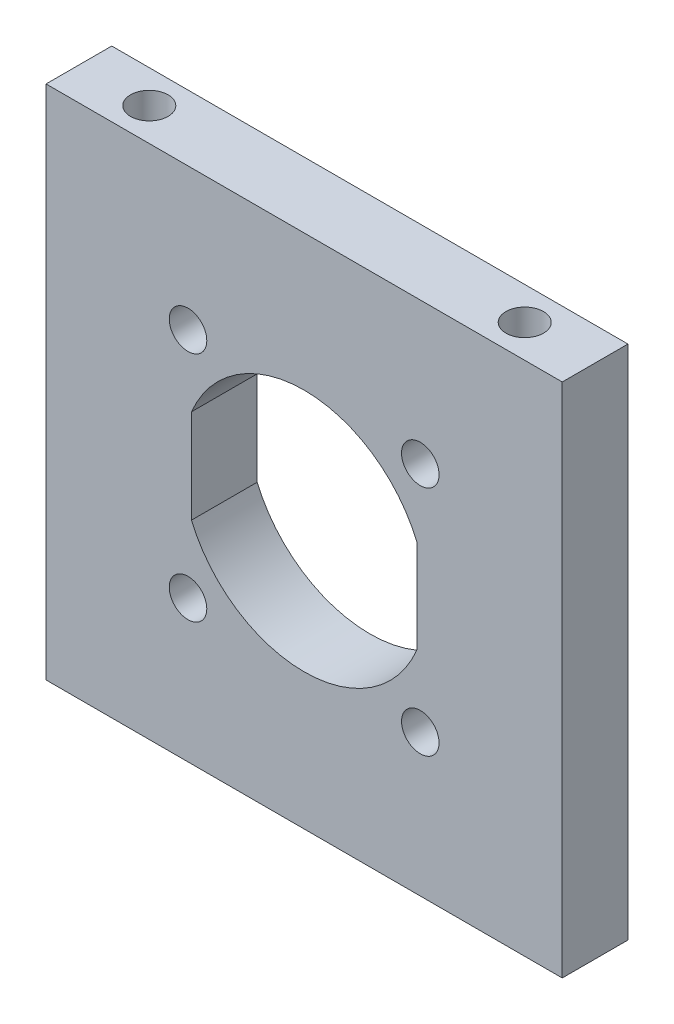
ISO-10303-21;
HEADER;
FILE_DESCRIPTION(('STEP AP214'),'2;1');
FILE_NAME('part.step','',(''),(''),'','','');
FILE_SCHEMA(('AUTOMOTIVE_DESIGN { 1 0 10303 214 1 1 1 1 }'));
ENDSEC;
DATA;
#1=APPLICATION_CONTEXT('core data for automotive mechanical design processes');
#2=APPLICATION_PROTOCOL_DEFINITION('international standard','automotive_design',2000,#1);
#3=PRODUCT_CONTEXT('',#1,'mechanical');
#4=PRODUCT('Part','Part','',(#3));
#5=PRODUCT_RELATED_PRODUCT_CATEGORY('part','',(#4));
#6=PRODUCT_DEFINITION_FORMATION('','',#4);
#7=PRODUCT_DEFINITION_CONTEXT('part definition',#1,'design');
#8=PRODUCT_DEFINITION('design','',#6,#7);
#9=PRODUCT_DEFINITION_SHAPE('','',#8);
#10=(LENGTH_UNIT() NAMED_UNIT(*) SI_UNIT(.MILLI.,.METRE.));
#11=(NAMED_UNIT(*) PLANE_ANGLE_UNIT() SI_UNIT($,.RADIAN.));
#12=(NAMED_UNIT(*) SI_UNIT($,.STERADIAN.) SOLID_ANGLE_UNIT());
#13=UNCERTAINTY_MEASURE_WITH_UNIT(LENGTH_MEASURE(1.E-05),#10,'distance_accuracy_value','');
#14=(GEOMETRIC_REPRESENTATION_CONTEXT(3) GLOBAL_UNCERTAINTY_ASSIGNED_CONTEXT((#13)) GLOBAL_UNIT_ASSIGNED_CONTEXT((#10,
#11,#12)) REPRESENTATION_CONTEXT('',''));
#15=CARTESIAN_POINT('',(0.,0.,0.));
#16=DIRECTION('',(0.,0.,1.));
#17=DIRECTION('',(1.,0.,0.));
#18=AXIS2_PLACEMENT_3D('',#15,#16,#17);
#19=CARTESIAN_POINT('',(0.,0.,7.));
#20=DIRECTION('',(0.,0.,1.));
#21=DIRECTION('',(1.,0.,0.));
#22=AXIS2_PLACEMENT_3D('',#19,#20,#21);
#23=PLANE('',#22);
#24=CARTESIAN_POINT('',(12.3743686707653,-12.3743686707639,7.));
#25=DIRECTION('',(0.,0.,1.));
#26=DIRECTION('',(1.,0.,0.));
#27=AXIS2_PLACEMENT_3D('',#24,#25,#26);
#28=CIRCLE('',#27,2.00000000000099);
#29=CARTESIAN_POINT('',(14.3743686707663,-12.3743686707639,7.));
#30=VERTEX_POINT('',#29);
#31=EDGE_CURVE('E246',#30,#30,#28,.T.);
#32=ORIENTED_EDGE('',*,*,#31,.F.);
#33=EDGE_LOOP('',(#32));
#34=FACE_BOUND('',#33,.T.);
#35=CARTESIAN_POINT('',(-12.3743686707646,12.3743686707646,7.));
#36=DIRECTION('',(0.,0.,1.));
#37=DIRECTION('',(1.,0.,0.));
#38=AXIS2_PLACEMENT_3D('',#35,#36,#37);
#39=CIRCLE('',#38,2.);
#40=CARTESIAN_POINT('',(-10.3743686707646,12.3743686707646,7.));
#41=VERTEX_POINT('',#40);
#42=EDGE_CURVE('E132',#41,#41,#39,.T.);
#43=ORIENTED_EDGE('',*,*,#42,.F.);
#44=EDGE_LOOP('',(#43));
#45=FACE_BOUND('',#44,.T.);
#46=DIRECTION('',(0.,1.,0.));
#47=VECTOR('',#46,1.);
#48=CARTESIAN_POINT('',(27.5,27.5,7.));
#49=LINE('',#48,#47);
#50=CARTESIAN_POINT('',(27.5,-27.5,7.));
#51=VERTEX_POINT('',#50);
#52=CARTESIAN_POINT('',(27.5,27.5,7.));
#53=VERTEX_POINT('',#52);
#54=EDGE_CURVE('E142',#51,#53,#49,.T.);
#55=ORIENTED_EDGE('',*,*,#54,.T.);
#56=DIRECTION('',(-1.,0.,0.));
#57=VECTOR('',#56,1.);
#58=CARTESIAN_POINT('',(-27.5,27.5,7.));
#59=LINE('',#58,#57);
#60=CARTESIAN_POINT('',(-27.5,27.5,7.));
#61=VERTEX_POINT('',#60);
#62=EDGE_CURVE('E145',#53,#61,#59,.T.);
#63=ORIENTED_EDGE('',*,*,#62,.T.);
#64=DIRECTION('',(0.,-1.,0.));
#65=VECTOR('',#64,1.);
#66=CARTESIAN_POINT('',(-27.5,27.5,7.));
#67=LINE('',#66,#65);
#68=CARTESIAN_POINT('',(-27.5,-27.5,7.));
#69=VERTEX_POINT('',#68);
#70=EDGE_CURVE('E148',#61,#69,#67,.T.);
#71=ORIENTED_EDGE('',*,*,#70,.T.);
#72=DIRECTION('',(1.,0.,0.));
#73=VECTOR('',#72,1.);
#74=CARTESIAN_POINT('',(-27.5,-27.5,7.));
#75=LINE('',#74,#73);
#76=EDGE_CURVE('E150',#69,#51,#75,.T.);
#77=ORIENTED_EDGE('',*,*,#76,.T.);
#78=EDGE_LOOP('',(#55,#63,#71,#77));
#79=FACE_BOUND('',#78,.T.);
#80=DIRECTION('',(0.,1.,0.));
#81=VECTOR('',#80,1.);
#82=CARTESIAN_POINT('',(12.,5.00000000000001,7.));
#83=LINE('',#82,#81);
#84=CARTESIAN_POINT('',(12.,-5.00000000000001,7.));
#85=VERTEX_POINT('',#84);
#86=CARTESIAN_POINT('',(12.,5.00000000000001,7.));
#87=VERTEX_POINT('',#86);
#88=EDGE_CURVE('E111',#85,#87,#83,.T.);
#89=ORIENTED_EDGE('',*,*,#88,.F.);
#90=CARTESIAN_POINT('',(0.,0.,7.));
#91=DIRECTION('',(0.,0.,1.));
#92=DIRECTION('',(1.,0.,0.));
#93=AXIS2_PLACEMENT_3D('',#90,#91,#92);
#94=CIRCLE('',#93,13.);
#95=CARTESIAN_POINT('',(-12.,-5.,7.));
#96=VERTEX_POINT('',#95);
#97=EDGE_CURVE('E103',#96,#85,#94,.T.);
#98=ORIENTED_EDGE('',*,*,#97,.F.);
#99=DIRECTION('',(0.,-1.,0.));
#100=VECTOR('',#99,1.);
#101=CARTESIAN_POINT('',(-12.,5.,7.));
#102=LINE('',#101,#100);
#103=CARTESIAN_POINT('',(-12.,5.,7.));
#104=VERTEX_POINT('',#103);
#105=EDGE_CURVE('E126',#104,#96,#102,.T.);
#106=ORIENTED_EDGE('',*,*,#105,.F.);
#107=CARTESIAN_POINT('',(0.,0.,7.));
#108=DIRECTION('',(0.,0.,1.));
#109=DIRECTION('',(1.,0.,0.));
#110=AXIS2_PLACEMENT_3D('',#107,#108,#109);
#111=CIRCLE('',#110,13.);
#112=EDGE_CURVE('E124',#87,#104,#111,.T.);
#113=ORIENTED_EDGE('',*,*,#112,.F.);
#114=EDGE_LOOP('',(#89,#98,#106,#113));
#115=FACE_BOUND('',#114,.T.);
#116=CARTESIAN_POINT('',(12.3743686707646,12.3743686707653,7.));
#117=DIRECTION('',(0.,0.,1.));
#118=DIRECTION('',(1.,0.,0.));
#119=AXIS2_PLACEMENT_3D('',#116,#117,#118);
#120=CIRCLE('',#119,2.00000000000073);
#121=CARTESIAN_POINT('',(14.3743686707653,12.3743686707653,7.));
#122=VERTEX_POINT('',#121);
#123=EDGE_CURVE('E252',#122,#122,#120,.T.);
#124=ORIENTED_EDGE('',*,*,#123,.F.);
#125=EDGE_LOOP('',(#124));
#126=FACE_BOUND('',#125,.T.);
#127=CARTESIAN_POINT('',(-12.3743686707639,-12.3743686707646,7.));
#128=DIRECTION('',(0.,0.,1.));
#129=DIRECTION('',(1.,0.,0.));
#130=AXIS2_PLACEMENT_3D('',#127,#128,#129);
#131=CIRCLE('',#130,2.00000000000038);
#132=CARTESIAN_POINT('',(-10.3743686707635,-12.3743686707646,7.));
#133=VERTEX_POINT('',#132);
#134=EDGE_CURVE('E240',#133,#133,#131,.T.);
#135=ORIENTED_EDGE('',*,*,#134,.F.);
#136=EDGE_LOOP('',(#135));
#137=FACE_BOUND('',#136,.T.);
#138=ADVANCED_FACE('F38',(#34,#45,#79,#115,#126,#137),#23,.T.);
#139=CARTESIAN_POINT('',(0.,0.,0.));
#140=DIRECTION('',(0.,0.,1.));
#141=DIRECTION('',(1.,0.,0.));
#142=AXIS2_PLACEMENT_3D('',#139,#140,#141);
#143=PLANE('',#142);
#144=DIRECTION('',(0.,1.,0.));
#145=VECTOR('',#144,1.);
#146=CARTESIAN_POINT('',(27.5,27.5,0.));
#147=LINE('',#146,#145);
#148=CARTESIAN_POINT('',(27.5,-27.5,0.));
#149=VERTEX_POINT('',#148);
#150=CARTESIAN_POINT('',(27.5,27.5,0.));
#151=VERTEX_POINT('',#150);
#152=EDGE_CURVE('E119',#149,#151,#147,.T.);
#153=ORIENTED_EDGE('',*,*,#152,.F.);
#154=DIRECTION('',(1.,0.,0.));
#155=VECTOR('',#154,1.);
#156=CARTESIAN_POINT('',(-27.5,-27.5,0.));
#157=LINE('',#156,#155);
#158=CARTESIAN_POINT('',(-27.5,-27.5,0.));
#159=VERTEX_POINT('',#158);
#160=EDGE_CURVE('E146',#159,#149,#157,.T.);
#161=ORIENTED_EDGE('',*,*,#160,.F.);
#162=DIRECTION('',(0.,-1.,0.));
#163=VECTOR('',#162,1.);
#164=CARTESIAN_POINT('',(-27.5,27.5,0.));
#165=LINE('',#164,#163);
#166=CARTESIAN_POINT('',(-27.5,27.5,0.));
#167=VERTEX_POINT('',#166);
#168=EDGE_CURVE('E157',#167,#159,#165,.T.);
#169=ORIENTED_EDGE('',*,*,#168,.F.);
#170=DIRECTION('',(-1.,0.,0.));
#171=VECTOR('',#170,1.);
#172=CARTESIAN_POINT('',(-27.5,27.5,0.));
#173=LINE('',#172,#171);
#174=EDGE_CURVE('E155',#151,#167,#173,.T.);
#175=ORIENTED_EDGE('',*,*,#174,.F.);
#176=EDGE_LOOP('',(#153,#161,#169,#175));
#177=FACE_BOUND('',#176,.T.);
#178=CARTESIAN_POINT('',(0.,0.,0.));
#179=DIRECTION('',(0.,0.,1.));
#180=DIRECTION('',(1.,0.,0.));
#181=AXIS2_PLACEMENT_3D('',#178,#179,#180);
#182=CIRCLE('',#181,13.);
#183=CARTESIAN_POINT('',(-12.,-5.,0.));
#184=VERTEX_POINT('',#183);
#185=CARTESIAN_POINT('',(12.,-5.00000000000001,0.));
#186=VERTEX_POINT('',#185);
#187=EDGE_CURVE('E61',#184,#186,#182,.T.);
#188=ORIENTED_EDGE('',*,*,#187,.T.);
#189=DIRECTION('',(0.,1.,0.));
#190=VECTOR('',#189,1.);
#191=CARTESIAN_POINT('',(12.,5.00000000000001,0.));
#192=LINE('',#191,#190);
#193=CARTESIAN_POINT('',(12.,5.00000000000001,0.));
#194=VERTEX_POINT('',#193);
#195=EDGE_CURVE('E118',#186,#194,#192,.T.);
#196=ORIENTED_EDGE('',*,*,#195,.T.);
#197=CARTESIAN_POINT('',(0.,0.,0.));
#198=DIRECTION('',(0.,0.,1.));
#199=DIRECTION('',(1.,0.,0.));
#200=AXIS2_PLACEMENT_3D('',#197,#198,#199);
#201=CIRCLE('',#200,13.);
#202=CARTESIAN_POINT('',(-12.,5.,0.));
#203=VERTEX_POINT('',#202);
#204=EDGE_CURVE('E134',#194,#203,#201,.T.);
#205=ORIENTED_EDGE('',*,*,#204,.T.);
#206=DIRECTION('',(0.,-1.,0.));
#207=VECTOR('',#206,1.);
#208=CARTESIAN_POINT('',(-12.,5.,0.));
#209=LINE('',#208,#207);
#210=EDGE_CURVE('E112',#203,#184,#209,.T.);
#211=ORIENTED_EDGE('',*,*,#210,.T.);
#212=EDGE_LOOP('',(#188,#196,#205,#211));
#213=FACE_BOUND('',#212,.T.);
#214=CARTESIAN_POINT('',(-12.3743686707646,12.3743686707646,0.));
#215=DIRECTION('',(0.,0.,1.));
#216=DIRECTION('',(1.,0.,0.));
#217=AXIS2_PLACEMENT_3D('',#214,#215,#216);
#218=CIRCLE('',#217,2.);
#219=CARTESIAN_POINT('',(-10.3743686707646,12.3743686707646,0.));
#220=VERTEX_POINT('',#219);
#221=EDGE_CURVE('E255',#220,#220,#218,.T.);
#222=ORIENTED_EDGE('',*,*,#221,.T.);
#223=EDGE_LOOP('',(#222));
#224=FACE_BOUND('',#223,.T.);
#225=CARTESIAN_POINT('',(12.3743686707646,12.3743686707653,0.));
#226=DIRECTION('',(0.,0.,1.));
#227=DIRECTION('',(1.,0.,0.));
#228=AXIS2_PLACEMENT_3D('',#225,#226,#227);
#229=CIRCLE('',#228,2.00000000000073);
#230=CARTESIAN_POINT('',(14.3743686707653,12.3743686707653,0.));
#231=VERTEX_POINT('',#230);
#232=EDGE_CURVE('E249',#231,#231,#229,.T.);
#233=ORIENTED_EDGE('',*,*,#232,.T.);
#234=EDGE_LOOP('',(#233));
#235=FACE_BOUND('',#234,.T.);
#236=CARTESIAN_POINT('',(12.3743686707653,-12.3743686707639,0.));
#237=DIRECTION('',(0.,0.,1.));
#238=DIRECTION('',(1.,0.,0.));
#239=AXIS2_PLACEMENT_3D('',#236,#237,#238);
#240=CIRCLE('',#239,2.00000000000099);
#241=CARTESIAN_POINT('',(14.3743686707663,-12.3743686707639,0.));
#242=VERTEX_POINT('',#241);
#243=EDGE_CURVE('E243',#242,#242,#240,.T.);
#244=ORIENTED_EDGE('',*,*,#243,.T.);
#245=EDGE_LOOP('',(#244));
#246=FACE_BOUND('',#245,.T.);
#247=CARTESIAN_POINT('',(-12.3743686707639,-12.3743686707646,0.));
#248=DIRECTION('',(0.,0.,1.));
#249=DIRECTION('',(1.,0.,0.));
#250=AXIS2_PLACEMENT_3D('',#247,#248,#249);
#251=CIRCLE('',#250,2.00000000000038);
#252=CARTESIAN_POINT('',(-10.3743686707635,-12.3743686707646,0.));
#253=VERTEX_POINT('',#252);
#254=EDGE_CURVE('E229',#253,#253,#251,.T.);
#255=ORIENTED_EDGE('',*,*,#254,.T.);
#256=EDGE_LOOP('',(#255));
#257=FACE_BOUND('',#256,.T.);
#258=ADVANCED_FACE('F175',(#177,#213,#224,#235,#246,#257),#143,.F.);
#259=CARTESIAN_POINT('',(27.5,27.5,7.));
#260=DIRECTION('',(-1.,0.,0.));
#261=DIRECTION('',(0.,-1.,0.));
#262=AXIS2_PLACEMENT_3D('',#259,#260,#261);
#263=PLANE('',#262);
#264=ORIENTED_EDGE('',*,*,#152,.T.);
#265=DIRECTION('',(0.,0.,-1.));
#266=VECTOR('',#265,1.);
#267=CARTESIAN_POINT('',(27.5,27.5,7.));
#268=LINE('',#267,#266);
#269=EDGE_CURVE('E11',#53,#151,#268,.T.);
#270=ORIENTED_EDGE('',*,*,#269,.F.);
#271=ORIENTED_EDGE('',*,*,#54,.F.);
#272=DIRECTION('',(0.,0.,-1.));
#273=VECTOR('',#272,1.);
#274=CARTESIAN_POINT('',(27.5,-27.5,7.));
#275=LINE('',#274,#273);
#276=EDGE_CURVE('E152',#51,#149,#275,.T.);
#277=ORIENTED_EDGE('',*,*,#276,.T.);
#278=EDGE_LOOP('',(#264,#270,#271,#277));
#279=FACE_BOUND('',#278,.T.);
#280=ADVANCED_FACE('F40',(#279),#263,.F.);
#281=CARTESIAN_POINT('',(-27.5,27.5,7.));
#282=DIRECTION('',(0.,-1.,0.));
#283=DIRECTION('',(0.,0.,-1.));
#284=AXIS2_PLACEMENT_3D('',#281,#282,#283);
#285=PLANE('',#284);
#286=CARTESIAN_POINT('',(-20.,27.5,3.5));
#287=DIRECTION('',(0.,1.,0.));
#288=DIRECTION('',(0.,0.,1.));
#289=AXIS2_PLACEMENT_3D('',#286,#287,#288);
#290=CIRCLE('',#289,2.);
#291=CARTESIAN_POINT('',(-20.,27.5,5.5));
#292=VERTEX_POINT('',#291);
#293=EDGE_CURVE('E230',#292,#292,#290,.T.);
#294=ORIENTED_EDGE('',*,*,#293,.F.);
#295=EDGE_LOOP('',(#294));
#296=FACE_BOUND('',#295,.T.);
#297=CARTESIAN_POINT('',(20.,27.5,3.5));
#298=DIRECTION('',(0.,1.,0.));
#299=DIRECTION('',(0.,0.,-1.));
#300=AXIS2_PLACEMENT_3D('',#297,#298,#299);
#301=CIRCLE('',#300,2.);
#302=CARTESIAN_POINT('',(20.,27.5,1.5));
#303=VERTEX_POINT('',#302);
#304=EDGE_CURVE('E236',#303,#303,#301,.T.);
#305=ORIENTED_EDGE('',*,*,#304,.F.);
#306=EDGE_LOOP('',(#305));
#307=FACE_BOUND('',#306,.T.);
#308=ORIENTED_EDGE('',*,*,#174,.T.);
#309=DIRECTION('',(0.,0.,-1.));
#310=VECTOR('',#309,1.);
#311=CARTESIAN_POINT('',(-27.5,27.5,7.));
#312=LINE('',#311,#310);
#313=EDGE_CURVE('E46',#61,#167,#312,.T.);
#314=ORIENTED_EDGE('',*,*,#313,.F.);
#315=ORIENTED_EDGE('',*,*,#62,.F.);
#316=ORIENTED_EDGE('',*,*,#269,.T.);
#317=EDGE_LOOP('',(#308,#314,#315,#316));
#318=FACE_BOUND('',#317,.T.);
#319=ADVANCED_FACE('F185',(#296,#307,#318),#285,.F.);
#320=CARTESIAN_POINT('',(-27.5,27.5,7.));
#321=DIRECTION('',(1.,0.,0.));
#322=DIRECTION('',(0.,1.,0.));
#323=AXIS2_PLACEMENT_3D('',#320,#321,#322);
#324=PLANE('',#323);
#325=ORIENTED_EDGE('',*,*,#168,.T.);
#326=DIRECTION('',(0.,0.,-1.));
#327=VECTOR('',#326,1.);
#328=CARTESIAN_POINT('',(-27.5,-27.5,7.));
#329=LINE('',#328,#327);
#330=EDGE_CURVE('E162',#69,#159,#329,.T.);
#331=ORIENTED_EDGE('',*,*,#330,.F.);
#332=ORIENTED_EDGE('',*,*,#70,.F.);
#333=ORIENTED_EDGE('',*,*,#313,.T.);
#334=EDGE_LOOP('',(#325,#331,#332,#333));
#335=FACE_BOUND('',#334,.T.);
#336=ADVANCED_FACE('F169',(#335),#324,.F.);
#337=CARTESIAN_POINT('',(-27.5,-27.5,7.));
#338=DIRECTION('',(0.,1.,0.));
#339=DIRECTION('',(0.,0.,1.));
#340=AXIS2_PLACEMENT_3D('',#337,#338,#339);
#341=PLANE('',#340);
#342=CARTESIAN_POINT('',(-20.,-27.5,3.5));
#343=DIRECTION('',(0.,-1.,0.));
#344=DIRECTION('',(0.,0.,-1.));
#345=AXIS2_PLACEMENT_3D('',#342,#343,#344);
#346=CIRCLE('',#345,2.);
#347=CARTESIAN_POINT('',(-20.,-27.5,1.5));
#348=VERTEX_POINT('',#347);
#349=EDGE_CURVE('E215',#348,#348,#346,.T.);
#350=ORIENTED_EDGE('',*,*,#349,.F.);
#351=EDGE_LOOP('',(#350));
#352=FACE_BOUND('',#351,.T.);
#353=CARTESIAN_POINT('',(20.,-27.5,3.49999999999996));
#354=DIRECTION('',(0.,-1.,0.));
#355=DIRECTION('',(0.,0.,1.));
#356=AXIS2_PLACEMENT_3D('',#353,#354,#355);
#357=CIRCLE('',#356,2.);
#358=CARTESIAN_POINT('',(20.,-27.5,5.49999999999997));
#359=VERTEX_POINT('',#358);
#360=EDGE_CURVE('E218',#359,#359,#357,.T.);
#361=ORIENTED_EDGE('',*,*,#360,.F.);
#362=EDGE_LOOP('',(#361));
#363=FACE_BOUND('',#362,.T.);
#364=ORIENTED_EDGE('',*,*,#160,.T.);
#365=ORIENTED_EDGE('',*,*,#276,.F.);
#366=ORIENTED_EDGE('',*,*,#76,.F.);
#367=ORIENTED_EDGE('',*,*,#330,.T.);
#368=EDGE_LOOP('',(#364,#365,#366,#367));
#369=FACE_BOUND('',#368,.T.);
#370=ADVANCED_FACE('F179',(#352,#363,#369),#341,.F.);
#371=CARTESIAN_POINT('',(0.,0.,7.));
#372=DIRECTION('',(0.,0.,-1.));
#373=DIRECTION('',(-1.,0.,0.));
#374=AXIS2_PLACEMENT_3D('',#371,#372,#373);
#375=CYLINDRICAL_SURFACE('',#374,13.);
#376=ORIENTED_EDGE('',*,*,#187,.F.);
#377=DIRECTION('',(0.,0.,-1.));
#378=VECTOR('',#377,1.);
#379=CARTESIAN_POINT('',(-12.,-5.,7.));
#380=LINE('',#379,#378);
#381=EDGE_CURVE('E107',#96,#184,#380,.T.);
#382=ORIENTED_EDGE('',*,*,#381,.F.);
#383=ORIENTED_EDGE('',*,*,#97,.T.);
#384=DIRECTION('',(0.,0.,-1.));
#385=VECTOR('',#384,1.);
#386=CARTESIAN_POINT('',(12.,-5.00000000000001,7.));
#387=LINE('',#386,#385);
#388=EDGE_CURVE('E106',#85,#186,#387,.T.);
#389=ORIENTED_EDGE('',*,*,#388,.T.);
#390=EDGE_LOOP('',(#376,#382,#383,#389));
#391=FACE_BOUND('',#390,.T.);
#392=ADVANCED_FACE('F105',(#391),#375,.F.);
#393=CARTESIAN_POINT('',(12.,5.00000000000001,7.));
#394=DIRECTION('',(-1.,0.,0.));
#395=DIRECTION('',(0.,0.,1.));
#396=AXIS2_PLACEMENT_3D('',#393,#394,#395);
#397=PLANE('',#396);
#398=ORIENTED_EDGE('',*,*,#195,.F.);
#399=ORIENTED_EDGE('',*,*,#388,.F.);
#400=ORIENTED_EDGE('',*,*,#88,.T.);
#401=DIRECTION('',(0.,0.,-1.));
#402=VECTOR('',#401,1.);
#403=CARTESIAN_POINT('',(12.,5.00000000000001,7.));
#404=LINE('',#403,#402);
#405=EDGE_CURVE('E120',#87,#194,#404,.T.);
#406=ORIENTED_EDGE('',*,*,#405,.T.);
#407=EDGE_LOOP('',(#398,#399,#400,#406));
#408=FACE_BOUND('',#407,.T.);
#409=ADVANCED_FACE('F115',(#408),#397,.T.);
#410=CARTESIAN_POINT('',(0.,0.,7.));
#411=DIRECTION('',(0.,0.,-1.));
#412=DIRECTION('',(-1.,0.,0.));
#413=AXIS2_PLACEMENT_3D('',#410,#411,#412);
#414=CYLINDRICAL_SURFACE('',#413,13.);
#415=ORIENTED_EDGE('',*,*,#204,.F.);
#416=ORIENTED_EDGE('',*,*,#405,.F.);
#417=ORIENTED_EDGE('',*,*,#112,.T.);
#418=DIRECTION('',(0.,0.,-1.));
#419=VECTOR('',#418,1.);
#420=CARTESIAN_POINT('',(-12.,5.,7.));
#421=LINE('',#420,#419);
#422=EDGE_CURVE('E53',#104,#203,#421,.T.);
#423=ORIENTED_EDGE('',*,*,#422,.T.);
#424=EDGE_LOOP('',(#415,#416,#417,#423));
#425=FACE_BOUND('',#424,.T.);
#426=ADVANCED_FACE('F277',(#425),#414,.F.);
#427=CARTESIAN_POINT('',(-12.,5.,7.));
#428=DIRECTION('',(1.,0.,0.));
#429=DIRECTION('',(0.,0.,-1.));
#430=AXIS2_PLACEMENT_3D('',#427,#428,#429);
#431=PLANE('',#430);
#432=ORIENTED_EDGE('',*,*,#210,.F.);
#433=ORIENTED_EDGE('',*,*,#422,.F.);
#434=ORIENTED_EDGE('',*,*,#105,.T.);
#435=ORIENTED_EDGE('',*,*,#381,.T.);
#436=EDGE_LOOP('',(#432,#433,#434,#435));
#437=FACE_BOUND('',#436,.T.);
#438=ADVANCED_FACE('F267',(#437),#431,.T.);
#439=CARTESIAN_POINT('',(-12.3743686707646,12.3743686707646,7.));
#440=DIRECTION('',(0.,0.,-1.));
#441=DIRECTION('',(-1.,0.,0.));
#442=AXIS2_PLACEMENT_3D('',#439,#440,#441);
#443=CYLINDRICAL_SURFACE('',#442,2.);
#444=ORIENTED_EDGE('',*,*,#42,.T.);
#445=EDGE_LOOP('',(#444));
#446=FACE_BOUND('',#445,.T.);
#447=ORIENTED_EDGE('',*,*,#221,.F.);
#448=EDGE_LOOP('',(#447));
#449=FACE_BOUND('',#448,.T.);
#450=ADVANCED_FACE('F264',(#446,#449),#443,.F.);
#451=CARTESIAN_POINT('',(12.3743686707646,12.3743686707653,7.));
#452=DIRECTION('',(0.,0.,-1.));
#453=DIRECTION('',(-1.,0.,0.));
#454=AXIS2_PLACEMENT_3D('',#451,#452,#453);
#455=CYLINDRICAL_SURFACE('',#454,2.00000000000073);
#456=ORIENTED_EDGE('',*,*,#123,.T.);
#457=EDGE_LOOP('',(#456));
#458=FACE_BOUND('',#457,.T.);
#459=ORIENTED_EDGE('',*,*,#232,.F.);
#460=EDGE_LOOP('',(#459));
#461=FACE_BOUND('',#460,.T.);
#462=ADVANCED_FACE('F266',(#458,#461),#455,.F.);
#463=CARTESIAN_POINT('',(12.3743686707653,-12.3743686707639,7.));
#464=DIRECTION('',(0.,0.,-1.));
#465=DIRECTION('',(-1.,0.,0.));
#466=AXIS2_PLACEMENT_3D('',#463,#464,#465);
#467=CYLINDRICAL_SURFACE('',#466,2.00000000000099);
#468=ORIENTED_EDGE('',*,*,#31,.T.);
#469=EDGE_LOOP('',(#468));
#470=FACE_BOUND('',#469,.T.);
#471=ORIENTED_EDGE('',*,*,#243,.F.);
#472=EDGE_LOOP('',(#471));
#473=FACE_BOUND('',#472,.T.);
#474=ADVANCED_FACE('F274',(#470,#473),#467,.F.);
#475=CARTESIAN_POINT('',(-12.3743686707639,-12.3743686707646,7.));
#476=DIRECTION('',(0.,0.,-1.));
#477=DIRECTION('',(-1.,0.,0.));
#478=AXIS2_PLACEMENT_3D('',#475,#476,#477);
#479=CYLINDRICAL_SURFACE('',#478,2.00000000000038);
#480=ORIENTED_EDGE('',*,*,#134,.T.);
#481=EDGE_LOOP('',(#480));
#482=FACE_BOUND('',#481,.T.);
#483=ORIENTED_EDGE('',*,*,#254,.F.);
#484=EDGE_LOOP('',(#483));
#485=FACE_BOUND('',#484,.T.);
#486=ADVANCED_FACE('F315',(#482,#485),#479,.F.);
#487=CARTESIAN_POINT('',(20.,18.5,3.5));
#488=DIRECTION('',(0.,1.,0.));
#489=DIRECTION('',(0.,0.,1.));
#490=AXIS2_PLACEMENT_3D('',#487,#488,#489);
#491=CYLINDRICAL_SURFACE('',#490,2.);
#492=CARTESIAN_POINT('',(20.,18.5,3.5));
#493=DIRECTION('',(0.,1.,0.));
#494=DIRECTION('',(0.,0.,-1.));
#495=AXIS2_PLACEMENT_3D('',#492,#493,#494);
#496=CIRCLE('',#495,2.);
#497=CARTESIAN_POINT('',(20.,18.5,1.5));
#498=VERTEX_POINT('',#497);
#499=EDGE_CURVE('E233',#498,#498,#496,.T.);
#500=ORIENTED_EDGE('',*,*,#499,.F.);
#501=EDGE_LOOP('',(#500));
#502=FACE_BOUND('',#501,.T.);
#503=ORIENTED_EDGE('',*,*,#304,.T.);
#504=EDGE_LOOP('',(#503));
#505=FACE_BOUND('',#504,.T.);
#506=ADVANCED_FACE('F323',(#502,#505),#491,.F.);
#507=CARTESIAN_POINT('',(20.,18.5,3.5));
#508=DIRECTION('',(0.,-1.,0.));
#509=DIRECTION('',(0.,0.,-1.));
#510=AXIS2_PLACEMENT_3D('',#507,#508,#509);
#511=PLANE('',#510);
#512=ORIENTED_EDGE('',*,*,#499,.T.);
#513=EDGE_LOOP('',(#512));
#514=FACE_BOUND('',#513,.T.);
#515=ADVANCED_FACE('F340',(#514),#511,.F.);
#516=CARTESIAN_POINT('',(-20.,18.5,3.5));
#517=DIRECTION('',(0.,1.,0.));
#518=DIRECTION('',(0.,0.,1.));
#519=AXIS2_PLACEMENT_3D('',#516,#517,#518);
#520=CYLINDRICAL_SURFACE('',#519,2.);
#521=CARTESIAN_POINT('',(-20.,18.5,3.5));
#522=DIRECTION('',(0.,1.,0.));
#523=DIRECTION('',(0.,0.,1.));
#524=AXIS2_PLACEMENT_3D('',#521,#522,#523);
#525=CIRCLE('',#524,2.);
#526=CARTESIAN_POINT('',(-20.,18.5,5.5));
#527=VERTEX_POINT('',#526);
#528=EDGE_CURVE('E226',#527,#527,#525,.T.);
#529=ORIENTED_EDGE('',*,*,#528,.F.);
#530=EDGE_LOOP('',(#529));
#531=FACE_BOUND('',#530,.T.);
#532=ORIENTED_EDGE('',*,*,#293,.T.);
#533=EDGE_LOOP('',(#532));
#534=FACE_BOUND('',#533,.T.);
#535=ADVANCED_FACE('F350',(#531,#534),#520,.F.);
#536=CARTESIAN_POINT('',(-20.,18.5,3.5));
#537=DIRECTION('',(0.,1.,0.));
#538=DIRECTION('',(0.,0.,1.));
#539=AXIS2_PLACEMENT_3D('',#536,#537,#538);
#540=PLANE('',#539);
#541=ORIENTED_EDGE('',*,*,#528,.T.);
#542=EDGE_LOOP('',(#541));
#543=FACE_BOUND('',#542,.T.);
#544=ADVANCED_FACE('F360',(#543),#540,.T.);
#545=CARTESIAN_POINT('',(20.,-18.5,3.49999999999996));
#546=DIRECTION('',(0.,-1.,0.));
#547=DIRECTION('',(0.,0.,-1.));
#548=AXIS2_PLACEMENT_3D('',#545,#546,#547);
#549=CYLINDRICAL_SURFACE('',#548,2.);
#550=CARTESIAN_POINT('',(20.,-18.5,3.49999999999996));
#551=DIRECTION('',(0.,-1.,0.));
#552=DIRECTION('',(0.,0.,1.));
#553=AXIS2_PLACEMENT_3D('',#550,#551,#552);
#554=CIRCLE('',#553,2.);
#555=CARTESIAN_POINT('',(20.,-18.5,5.49999999999997));
#556=VERTEX_POINT('',#555);
#557=EDGE_CURVE('E220',#556,#556,#554,.T.);
#558=ORIENTED_EDGE('',*,*,#557,.F.);
#559=EDGE_LOOP('',(#558));
#560=FACE_BOUND('',#559,.T.);
#561=ORIENTED_EDGE('',*,*,#360,.T.);
#562=EDGE_LOOP('',(#561));
#563=FACE_BOUND('',#562,.T.);
#564=ADVANCED_FACE('F369',(#560,#563),#549,.F.);
#565=CARTESIAN_POINT('',(20.,-18.5,3.49999999999996));
#566=DIRECTION('',(0.,1.,0.));
#567=DIRECTION('',(0.,0.,1.));
#568=AXIS2_PLACEMENT_3D('',#565,#566,#567);
#569=PLANE('',#568);
#570=ORIENTED_EDGE('',*,*,#557,.T.);
#571=EDGE_LOOP('',(#570));
#572=FACE_BOUND('',#571,.T.);
#573=ADVANCED_FACE('F385',(#572),#569,.F.);
#574=CARTESIAN_POINT('',(-20.,-18.5,3.5));
#575=DIRECTION('',(0.,-1.,0.));
#576=DIRECTION('',(0.,0.,-1.));
#577=AXIS2_PLACEMENT_3D('',#574,#575,#576);
#578=CYLINDRICAL_SURFACE('',#577,2.);
#579=CARTESIAN_POINT('',(-20.,-18.5,3.5));
#580=DIRECTION('',(0.,-1.,0.));
#581=DIRECTION('',(0.,0.,-1.));
#582=AXIS2_PLACEMENT_3D('',#579,#580,#581);
#583=CIRCLE('',#582,2.);
#584=CARTESIAN_POINT('',(-20.,-18.5,1.5));
#585=VERTEX_POINT('',#584);
#586=EDGE_CURVE('E239',#585,#585,#583,.T.);
#587=ORIENTED_EDGE('',*,*,#586,.F.);
#588=EDGE_LOOP('',(#587));
#589=FACE_BOUND('',#588,.T.);
#590=ORIENTED_EDGE('',*,*,#349,.T.);
#591=EDGE_LOOP('',(#590));
#592=FACE_BOUND('',#591,.T.);
#593=ADVANCED_FACE('F395',(#589,#592),#578,.F.);
#594=CARTESIAN_POINT('',(-20.,-18.5,3.5));
#595=DIRECTION('',(0.,-1.,0.));
#596=DIRECTION('',(0.,0.,-1.));
#597=AXIS2_PLACEMENT_3D('',#594,#595,#596);
#598=PLANE('',#597);
#599=ORIENTED_EDGE('',*,*,#586,.T.);
#600=EDGE_LOOP('',(#599));
#601=FACE_BOUND('',#600,.T.);
#602=ADVANCED_FACE('F405',(#601),#598,.T.);
#603=CLOSED_SHELL('',(#138,#258,#280,#319,#336,#370,#392,#409,#426,#438,#450,#462,#474,#486,
#506,#515,#535,#544,#564,#573,#593,#602));
#604=MANIFOLD_SOLID_BREP('B2',#603);
#605=ADVANCED_BREP_SHAPE_REPRESENTATION('',(#18,#604),#14);
#606=SHAPE_DEFINITION_REPRESENTATION(#9,#605);
ENDSEC;
END-ISO-10303-21;
